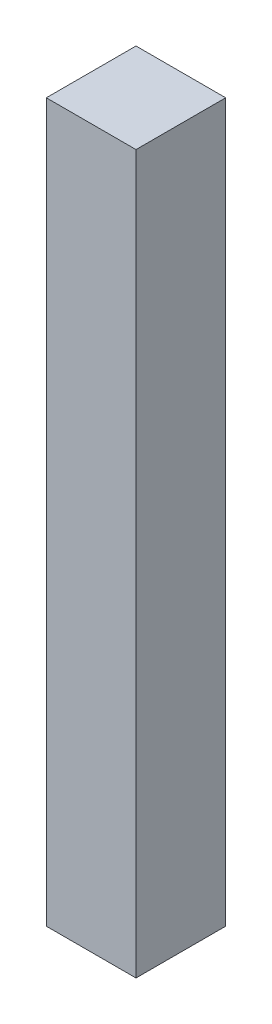
ISO-10303-21;
HEADER;
FILE_DESCRIPTION(('STEP AP214'),'2;1');
FILE_NAME('part.step','',(''),(''),'','','');
FILE_SCHEMA(('AUTOMOTIVE_DESIGN { 1 0 10303 214 1 1 1 1 }'));
ENDSEC;
DATA;
#1=APPLICATION_CONTEXT('core data for automotive mechanical design processes');
#2=APPLICATION_PROTOCOL_DEFINITION('international standard','automotive_design',2000,#1);
#3=PRODUCT_CONTEXT('',#1,'mechanical');
#4=PRODUCT('Part','Part','',(#3));
#5=PRODUCT_RELATED_PRODUCT_CATEGORY('part','',(#4));
#6=PRODUCT_DEFINITION_FORMATION('','',#4);
#7=PRODUCT_DEFINITION_CONTEXT('part definition',#1,'design');
#8=PRODUCT_DEFINITION('design','',#6,#7);
#9=PRODUCT_DEFINITION_SHAPE('','',#8);
#10=(LENGTH_UNIT() NAMED_UNIT(*) SI_UNIT(.MILLI.,.METRE.));
#11=(NAMED_UNIT(*) PLANE_ANGLE_UNIT() SI_UNIT($,.RADIAN.));
#12=(NAMED_UNIT(*) SI_UNIT($,.STERADIAN.) SOLID_ANGLE_UNIT());
#13=UNCERTAINTY_MEASURE_WITH_UNIT(LENGTH_MEASURE(1.E-05),#10,'distance_accuracy_value','');
#14=(GEOMETRIC_REPRESENTATION_CONTEXT(3) GLOBAL_UNCERTAINTY_ASSIGNED_CONTEXT((#13)) GLOBAL_UNIT_ASSIGNED_CONTEXT((#10,
#11,#12)) REPRESENTATION_CONTEXT('',''));
#15=CARTESIAN_POINT('',(0.,0.,0.));
#16=DIRECTION('',(0.,0.,1.));
#17=DIRECTION('',(1.,0.,0.));
#18=AXIS2_PLACEMENT_3D('',#15,#16,#17);
#19=CARTESIAN_POINT('',(0.,400.,0.));
#20=DIRECTION('',(1.,0.,0.));
#21=DIRECTION('',(0.,0.,-1.));
#22=AXIS2_PLACEMENT_3D('',#19,#20,#21);
#23=PLANE('',#22);
#24=DIRECTION('',(0.,0.,1.));
#25=VECTOR('',#24,1.);
#26=CARTESIAN_POINT('',(0.,0.,0.));
#27=LINE('',#26,#25);
#28=CARTESIAN_POINT('',(0.,0.,-50.));
#29=VERTEX_POINT('',#28);
#30=CARTESIAN_POINT('',(0.,0.,0.));
#31=VERTEX_POINT('',#30);
#32=EDGE_CURVE('E101',#29,#31,#27,.T.);
#33=ORIENTED_EDGE('',*,*,#32,.T.);
#34=DIRECTION('',(0.,-1.,0.));
#35=VECTOR('',#34,1.);
#36=CARTESIAN_POINT('',(0.,400.,0.));
#37=LINE('',#36,#35);
#38=CARTESIAN_POINT('',(0.,400.,0.));
#39=VERTEX_POINT('',#38);
#40=EDGE_CURVE('E11',#39,#31,#37,.T.);
#41=ORIENTED_EDGE('',*,*,#40,.F.);
#42=DIRECTION('',(0.,0.,1.));
#43=VECTOR('',#42,1.);
#44=CARTESIAN_POINT('',(0.,400.,0.));
#45=LINE('',#44,#43);
#46=CARTESIAN_POINT('',(0.,400.,-50.));
#47=VERTEX_POINT('',#46);
#48=EDGE_CURVE('E89',#47,#39,#45,.T.);
#49=ORIENTED_EDGE('',*,*,#48,.F.);
#50=DIRECTION('',(0.,-1.,0.));
#51=VECTOR('',#50,1.);
#52=CARTESIAN_POINT('',(0.,400.,-50.));
#53=LINE('',#52,#51);
#54=EDGE_CURVE('E97',#47,#29,#53,.T.);
#55=ORIENTED_EDGE('',*,*,#54,.T.);
#56=EDGE_LOOP('',(#33,#41,#49,#55));
#57=FACE_BOUND('',#56,.T.);
#58=ADVANCED_FACE('F38',(#57),#23,.F.);
#59=CARTESIAN_POINT('',(0.,400.,0.));
#60=DIRECTION('',(0.,0.,-1.));
#61=DIRECTION('',(-1.,0.,0.));
#62=AXIS2_PLACEMENT_3D('',#59,#60,#61);
#63=PLANE('',#62);
#64=DIRECTION('',(1.,0.,0.));
#65=VECTOR('',#64,1.);
#66=CARTESIAN_POINT('',(0.,0.,0.));
#67=LINE('',#66,#65);
#68=CARTESIAN_POINT('',(50.,0.,0.));
#69=VERTEX_POINT('',#68);
#70=EDGE_CURVE('E93',#31,#69,#67,.T.);
#71=ORIENTED_EDGE('',*,*,#70,.T.);
#72=DIRECTION('',(0.,-1.,0.));
#73=VECTOR('',#72,1.);
#74=CARTESIAN_POINT('',(50.,400.,0.));
#75=LINE('',#74,#73);
#76=CARTESIAN_POINT('',(50.,400.,0.));
#77=VERTEX_POINT('',#76);
#78=EDGE_CURVE('E46',#77,#69,#75,.T.);
#79=ORIENTED_EDGE('',*,*,#78,.F.);
#80=DIRECTION('',(1.,0.,0.));
#81=VECTOR('',#80,1.);
#82=CARTESIAN_POINT('',(0.,400.,0.));
#83=LINE('',#82,#81);
#84=EDGE_CURVE('E84',#39,#77,#83,.T.);
#85=ORIENTED_EDGE('',*,*,#84,.F.);
#86=ORIENTED_EDGE('',*,*,#40,.T.);
#87=EDGE_LOOP('',(#71,#79,#85,#86));
#88=FACE_BOUND('',#87,.T.);
#89=ADVANCED_FACE('F92',(#88),#63,.F.);
#90=CARTESIAN_POINT('',(50.,400.,0.));
#91=DIRECTION('',(-1.,0.,0.));
#92=DIRECTION('',(0.,0.,1.));
#93=AXIS2_PLACEMENT_3D('',#90,#91,#92);
#94=PLANE('',#93);
#95=DIRECTION('',(0.,0.,-1.));
#96=VECTOR('',#95,1.);
#97=CARTESIAN_POINT('',(50.,0.,0.));
#98=LINE('',#97,#96);
#99=CARTESIAN_POINT('',(50.,0.,-50.));
#100=VERTEX_POINT('',#99);
#101=EDGE_CURVE('E71',#69,#100,#98,.T.);
#102=ORIENTED_EDGE('',*,*,#101,.T.);
#103=DIRECTION('',(0.,-1.,0.));
#104=VECTOR('',#103,1.);
#105=CARTESIAN_POINT('',(50.,400.,-50.));
#106=LINE('',#105,#104);
#107=CARTESIAN_POINT('',(50.,400.,-50.));
#108=VERTEX_POINT('',#107);
#109=EDGE_CURVE('E94',#108,#100,#106,.T.);
#110=ORIENTED_EDGE('',*,*,#109,.F.);
#111=DIRECTION('',(0.,0.,-1.));
#112=VECTOR('',#111,1.);
#113=CARTESIAN_POINT('',(50.,400.,0.));
#114=LINE('',#113,#112);
#115=EDGE_CURVE('E87',#77,#108,#114,.T.);
#116=ORIENTED_EDGE('',*,*,#115,.F.);
#117=ORIENTED_EDGE('',*,*,#78,.T.);
#118=EDGE_LOOP('',(#102,#110,#116,#117));
#119=FACE_BOUND('',#118,.T.);
#120=ADVANCED_FACE('F95',(#119),#94,.F.);
#121=CARTESIAN_POINT('',(0.,400.,-50.));
#122=DIRECTION('',(0.,0.,1.));
#123=DIRECTION('',(1.,0.,0.));
#124=AXIS2_PLACEMENT_3D('',#121,#122,#123);
#125=PLANE('',#124);
#126=DIRECTION('',(-1.,0.,0.));
#127=VECTOR('',#126,1.);
#128=CARTESIAN_POINT('',(0.,0.,-50.));
#129=LINE('',#128,#127);
#130=EDGE_CURVE('E77',#100,#29,#129,.T.);
#131=ORIENTED_EDGE('',*,*,#130,.T.);
#132=ORIENTED_EDGE('',*,*,#54,.F.);
#133=DIRECTION('',(-1.,0.,0.));
#134=VECTOR('',#133,1.);
#135=CARTESIAN_POINT('',(0.,400.,-50.));
#136=LINE('',#135,#134);
#137=EDGE_CURVE('E54',#108,#47,#136,.T.);
#138=ORIENTED_EDGE('',*,*,#137,.F.);
#139=ORIENTED_EDGE('',*,*,#109,.T.);
#140=EDGE_LOOP('',(#131,#132,#138,#139));
#141=FACE_BOUND('',#140,.T.);
#142=ADVANCED_FACE('F108',(#141),#125,.F.);
#143=CARTESIAN_POINT('',(0.,400.,0.));
#144=DIRECTION('',(0.,-1.,0.));
#145=DIRECTION('',(0.,0.,-1.));
#146=AXIS2_PLACEMENT_3D('',#143,#144,#145);
#147=PLANE('',#146);
#148=ORIENTED_EDGE('',*,*,#48,.T.);
#149=ORIENTED_EDGE('',*,*,#84,.T.);
#150=ORIENTED_EDGE('',*,*,#115,.T.);
#151=ORIENTED_EDGE('',*,*,#137,.T.);
#152=EDGE_LOOP('',(#148,#149,#150,#151));
#153=FACE_BOUND('',#152,.T.);
#154=ADVANCED_FACE('F85',(#153),#147,.F.);
#155=CARTESIAN_POINT('',(0.,0.,0.));
#156=DIRECTION('',(0.,-1.,0.));
#157=DIRECTION('',(0.,0.,-1.));
#158=AXIS2_PLACEMENT_3D('',#155,#156,#157);
#159=PLANE('',#158);
#160=ORIENTED_EDGE('',*,*,#32,.F.);
#161=ORIENTED_EDGE('',*,*,#130,.F.);
#162=ORIENTED_EDGE('',*,*,#101,.F.);
#163=ORIENTED_EDGE('',*,*,#70,.F.);
#164=EDGE_LOOP('',(#160,#161,#162,#163));
#165=FACE_BOUND('',#164,.T.);
#166=ADVANCED_FACE('F111',(#165),#159,.T.);
#167=CLOSED_SHELL('',(#58,#89,#120,#142,#154,#166));
#168=MANIFOLD_SOLID_BREP('B2',#167);
#169=ADVANCED_BREP_SHAPE_REPRESENTATION('',(#18,#168),#14);
#170=SHAPE_DEFINITION_REPRESENTATION(#9,#169);
ENDSEC;
END-ISO-10303-21;
